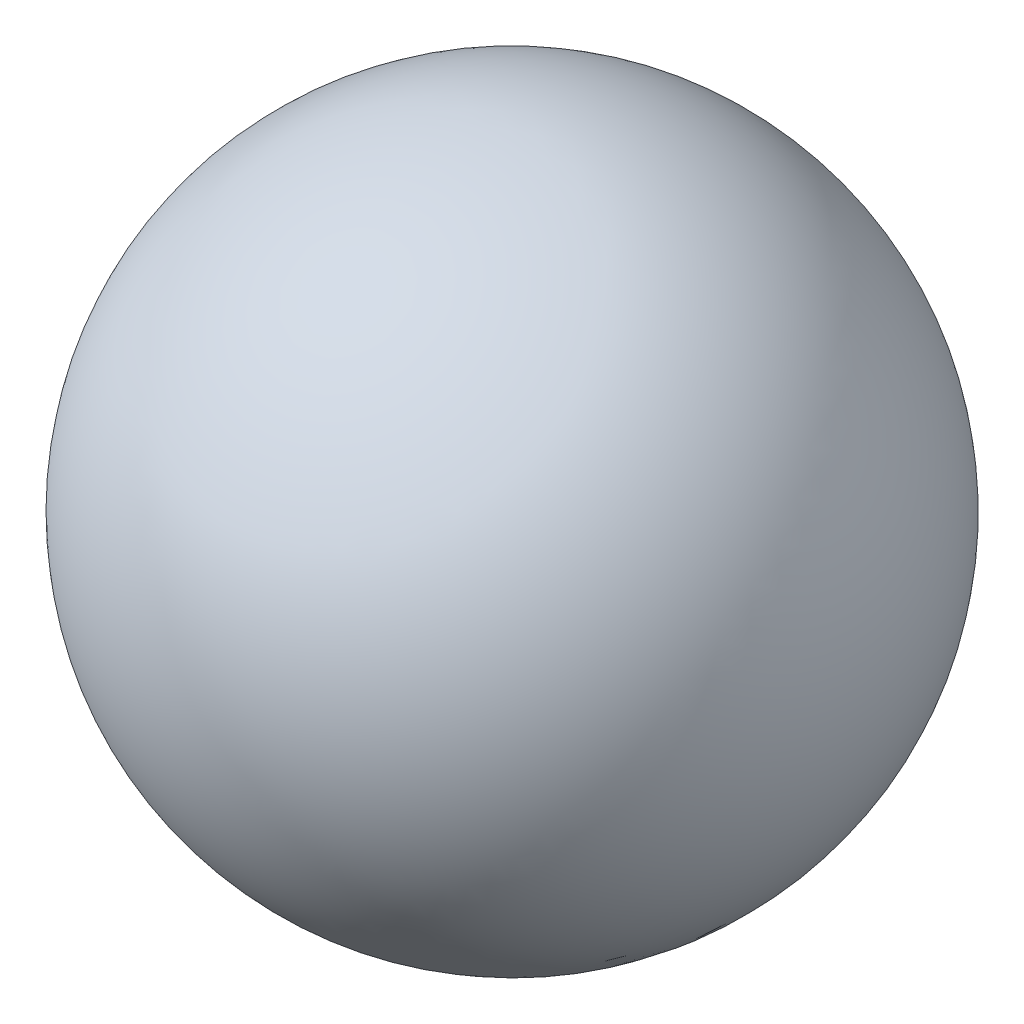
ISO-10303-21;
HEADER;
FILE_DESCRIPTION(('STEP AP214'),'2;1');
FILE_NAME('part.step','',(''),(''),'','','');
FILE_SCHEMA(('AUTOMOTIVE_DESIGN { 1 0 10303 214 1 1 1 1 }'));
ENDSEC;
DATA;
#1=APPLICATION_CONTEXT('core data for automotive mechanical design processes');
#2=APPLICATION_PROTOCOL_DEFINITION('international standard','automotive_design',2000,#1);
#3=PRODUCT_CONTEXT('',#1,'mechanical');
#4=PRODUCT('Part','Part','',(#3));
#5=PRODUCT_RELATED_PRODUCT_CATEGORY('part','',(#4));
#6=PRODUCT_DEFINITION_FORMATION('','',#4);
#7=PRODUCT_DEFINITION_CONTEXT('part definition',#1,'design');
#8=PRODUCT_DEFINITION('design','',#6,#7);
#9=PRODUCT_DEFINITION_SHAPE('','',#8);
#10=(LENGTH_UNIT() NAMED_UNIT(*) SI_UNIT(.MILLI.,.METRE.));
#11=(NAMED_UNIT(*) PLANE_ANGLE_UNIT() SI_UNIT($,.RADIAN.));
#12=(NAMED_UNIT(*) SI_UNIT($,.STERADIAN.) SOLID_ANGLE_UNIT());
#13=UNCERTAINTY_MEASURE_WITH_UNIT(LENGTH_MEASURE(1.E-05),#10,'distance_accuracy_value','');
#14=(GEOMETRIC_REPRESENTATION_CONTEXT(3) GLOBAL_UNCERTAINTY_ASSIGNED_CONTEXT((#13)) GLOBAL_UNIT_ASSIGNED_CONTEXT((#10,
#11,#12)) REPRESENTATION_CONTEXT('',''));
#15=CARTESIAN_POINT('',(0.,0.,0.));
#16=DIRECTION('',(0.,0.,1.));
#17=DIRECTION('',(1.,0.,0.));
#18=AXIS2_PLACEMENT_3D('',#15,#16,#17);
#19=CARTESIAN_POINT('',(0.,0.,0.));
#20=DIRECTION('',(0.502153993789784,0.391780094827006,0.770940804354207));
#21=DIRECTION('',(0.577952130414927,-0.815193903894097,0.0378184346945801));
#22=AXIS2_PLACEMENT_3D('',#19,#20,#21);
#23=SPHERICAL_SURFACE('',#22,1.1905);
#24=CARTESIAN_POINT('',(0.597814329606738,0.466414202891551,0.917805027583684));
#25=VERTEX_POINT('',#24);
#26=VERTEX_LOOP('',#25);
#27=FACE_BOUND('',#26,.T.);
#28=CARTESIAN_POINT('',(-0.597814329606737,-0.466414202891549,-0.917805027583684));
#29=VERTEX_POINT('',#28);
#30=VERTEX_LOOP('',#29);
#31=FACE_BOUND('',#30,.T.);
#32=ADVANCED_FACE('F15',(#27,#31),#23,.T.);
#33=CLOSED_SHELL('',(#32));
#34=MANIFOLD_SOLID_BREP('B1',#33);
#35=ADVANCED_BREP_SHAPE_REPRESENTATION('',(#18,#34),#14);
#36=SHAPE_DEFINITION_REPRESENTATION(#9,#35);
ENDSEC;
END-ISO-10303-21;
